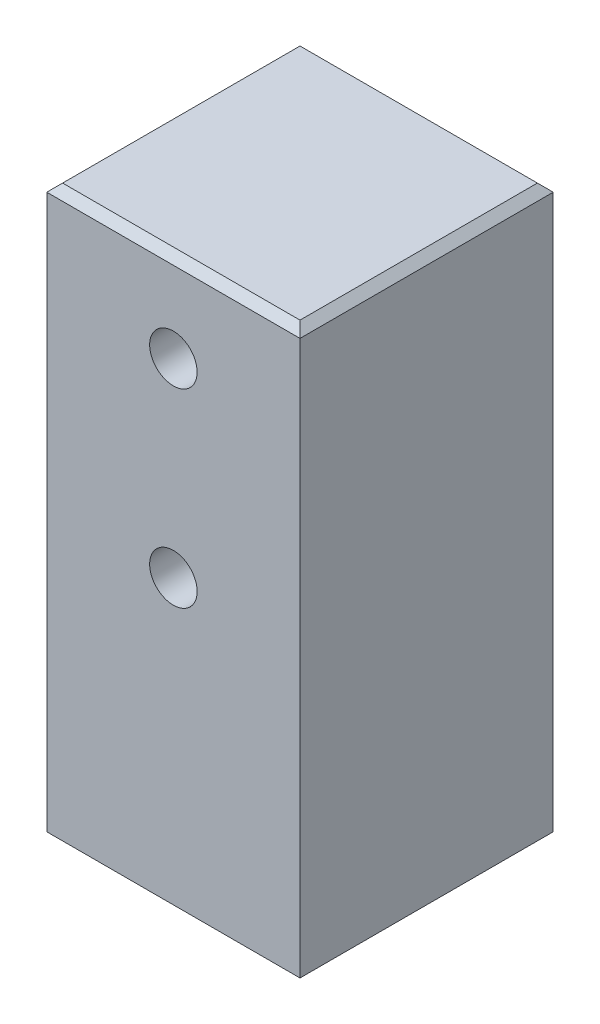
ISO-10303-21;
HEADER;
FILE_DESCRIPTION(('STEP AP214'),'2;1');
FILE_NAME('part.step','',(''),(''),'','','');
FILE_SCHEMA(('AUTOMOTIVE_DESIGN { 1 0 10303 214 1 1 1 1 }'));
ENDSEC;
DATA;
#1=APPLICATION_CONTEXT('core data for automotive mechanical design processes');
#2=APPLICATION_PROTOCOL_DEFINITION('international standard','automotive_design',2000,#1);
#3=PRODUCT_CONTEXT('',#1,'mechanical');
#4=PRODUCT('Part','Part','',(#3));
#5=PRODUCT_RELATED_PRODUCT_CATEGORY('part','',(#4));
#6=PRODUCT_DEFINITION_FORMATION('','',#4);
#7=PRODUCT_DEFINITION_CONTEXT('part definition',#1,'design');
#8=PRODUCT_DEFINITION('design','',#6,#7);
#9=PRODUCT_DEFINITION_SHAPE('','',#8);
#10=(LENGTH_UNIT() NAMED_UNIT(*) SI_UNIT(.MILLI.,.METRE.));
#11=(NAMED_UNIT(*) PLANE_ANGLE_UNIT() SI_UNIT($,.RADIAN.));
#12=(NAMED_UNIT(*) SI_UNIT($,.STERADIAN.) SOLID_ANGLE_UNIT());
#13=UNCERTAINTY_MEASURE_WITH_UNIT(LENGTH_MEASURE(1.E-05),#10,'distance_accuracy_value','');
#14=(GEOMETRIC_REPRESENTATION_CONTEXT(3) GLOBAL_UNCERTAINTY_ASSIGNED_CONTEXT((#13)) GLOBAL_UNIT_ASSIGNED_CONTEXT((#10,
#11,#12)) REPRESENTATION_CONTEXT('',''));
#15=CARTESIAN_POINT('',(0.,0.,0.));
#16=DIRECTION('',(0.,0.,1.));
#17=DIRECTION('',(1.,0.,0.));
#18=AXIS2_PLACEMENT_3D('',#15,#16,#17);
#19=CARTESIAN_POINT('',(12.7,28.575,-12.7));
#20=DIRECTION('',(-1.,0.,0.));
#21=DIRECTION('',(0.,0.,1.));
#22=AXIS2_PLACEMENT_3D('',#19,#20,#21);
#23=PLANE('',#22);
#24=DIRECTION('',(0.,-1.,0.));
#25=VECTOR('',#24,1.);
#26=CARTESIAN_POINT('',(12.7,28.575,-12.7));
#27=LINE('',#26,#25);
#28=CARTESIAN_POINT('',(12.7,27.78125,-12.7));
#29=VERTEX_POINT('',#28);
#30=CARTESIAN_POINT('',(12.7,-27.78125,-12.7));
#31=VERTEX_POINT('',#30);
#32=EDGE_CURVE('E118',#29,#31,#27,.T.);
#33=ORIENTED_EDGE('',*,*,#32,.F.);
#34=DIRECTION('',(0.,0.,1.));
#35=VECTOR('',#34,1.);
#36=CARTESIAN_POINT('',(12.7,27.78125,12.7));
#37=LINE('',#36,#35);
#38=CARTESIAN_POINT('',(12.7,27.78125,12.7));
#39=VERTEX_POINT('',#38);
#40=EDGE_CURVE('E142',#29,#39,#37,.T.);
#41=ORIENTED_EDGE('',*,*,#40,.T.);
#42=DIRECTION('',(0.,-1.,0.));
#43=VECTOR('',#42,1.);
#44=CARTESIAN_POINT('',(12.7,28.575,12.7));
#45=LINE('',#44,#43);
#46=CARTESIAN_POINT('',(12.7,-27.78125,12.7));
#47=VERTEX_POINT('',#46);
#48=EDGE_CURVE('E190',#39,#47,#45,.T.);
#49=ORIENTED_EDGE('',*,*,#48,.T.);
#50=DIRECTION('',(0.,0.,-1.));
#51=VECTOR('',#50,1.);
#52=CARTESIAN_POINT('',(12.7,-27.78125,-12.7));
#53=LINE('',#52,#51);
#54=EDGE_CURVE('E140',#47,#31,#53,.T.);
#55=ORIENTED_EDGE('',*,*,#54,.T.);
#56=EDGE_LOOP('',(#33,#41,#49,#55));
#57=FACE_BOUND('',#56,.T.);
#58=ADVANCED_FACE('F33',(#57),#23,.F.);
#59=CARTESIAN_POINT('',(-12.7,28.575,-12.7));
#60=DIRECTION('',(0.,0.,1.));
#61=DIRECTION('',(1.,0.,0.));
#62=AXIS2_PLACEMENT_3D('',#59,#60,#61);
#63=PLANE('',#62);
#64=CARTESIAN_POINT('',(0.,19.685,-12.7));
#65=DIRECTION('',(0.,0.,1.));
#66=DIRECTION('',(1.,0.,0.));
#67=AXIS2_PLACEMENT_3D('',#64,#65,#66);
#68=CIRCLE('',#67,2.38125);
#69=CARTESIAN_POINT('',(2.38125,19.685,-12.7));
#70=VERTEX_POINT('',#69);
#71=EDGE_CURVE('E479',#70,#70,#68,.T.);
#72=ORIENTED_EDGE('',*,*,#71,.T.);
#73=EDGE_LOOP('',(#72));
#74=FACE_BOUND('',#73,.T.);
#75=CARTESIAN_POINT('',(0.,0.635,-12.7));
#76=DIRECTION('',(0.,0.,1.));
#77=DIRECTION('',(1.,0.,0.));
#78=AXIS2_PLACEMENT_3D('',#75,#76,#77);
#79=CIRCLE('',#78,2.38125);
#80=CARTESIAN_POINT('',(2.38125,0.635,-12.7));
#81=VERTEX_POINT('',#80);
#82=EDGE_CURVE('E187',#81,#81,#79,.T.);
#83=ORIENTED_EDGE('',*,*,#82,.T.);
#84=EDGE_LOOP('',(#83));
#85=FACE_BOUND('',#84,.T.);
#86=DIRECTION('',(0.,-1.,0.));
#87=VECTOR('',#86,1.);
#88=CARTESIAN_POINT('',(-12.7,28.575,-12.7));
#89=LINE('',#88,#87);
#90=CARTESIAN_POINT('',(-12.7,27.78125,-12.7));
#91=VERTEX_POINT('',#90);
#92=CARTESIAN_POINT('',(-12.7,-27.78125,-12.7));
#93=VERTEX_POINT('',#92);
#94=EDGE_CURVE('E201',#91,#93,#89,.T.);
#95=ORIENTED_EDGE('',*,*,#94,.F.);
#96=DIRECTION('',(1.,0.,0.));
#97=VECTOR('',#96,1.);
#98=CARTESIAN_POINT('',(12.7,27.78125,-12.7));
#99=LINE('',#98,#97);
#100=EDGE_CURVE('E138',#91,#29,#99,.T.);
#101=ORIENTED_EDGE('',*,*,#100,.T.);
#102=ORIENTED_EDGE('',*,*,#32,.T.);
#103=DIRECTION('',(-1.,0.,0.));
#104=VECTOR('',#103,1.);
#105=CARTESIAN_POINT('',(-12.7,-27.78125,-12.7));
#106=LINE('',#105,#104);
#107=EDGE_CURVE('E135',#31,#93,#106,.T.);
#108=ORIENTED_EDGE('',*,*,#107,.T.);
#109=EDGE_LOOP('',(#95,#101,#102,#108));
#110=FACE_BOUND('',#109,.T.);
#111=ADVANCED_FACE('F220',(#74,#85,#110),#63,.F.);
#112=CARTESIAN_POINT('',(-12.7,28.575,-12.7));
#113=DIRECTION('',(1.,0.,0.));
#114=DIRECTION('',(0.,0.,-1.));
#115=AXIS2_PLACEMENT_3D('',#112,#113,#114);
#116=PLANE('',#115);
#117=DIRECTION('',(0.,-1.,0.));
#118=VECTOR('',#117,1.);
#119=CARTESIAN_POINT('',(-12.7,28.575,12.7));
#120=LINE('',#119,#118);
#121=CARTESIAN_POINT('',(-12.7,27.78125,12.7));
#122=VERTEX_POINT('',#121);
#123=CARTESIAN_POINT('',(-12.7,-27.78125,12.7));
#124=VERTEX_POINT('',#123);
#125=EDGE_CURVE('E198',#122,#124,#120,.T.);
#126=ORIENTED_EDGE('',*,*,#125,.F.);
#127=DIRECTION('',(0.,0.,-1.));
#128=VECTOR('',#127,1.);
#129=CARTESIAN_POINT('',(-12.7,27.78125,-12.7));
#130=LINE('',#129,#128);
#131=EDGE_CURVE('E133',#122,#91,#130,.T.);
#132=ORIENTED_EDGE('',*,*,#131,.T.);
#133=ORIENTED_EDGE('',*,*,#94,.T.);
#134=DIRECTION('',(0.,0.,1.));
#135=VECTOR('',#134,1.);
#136=CARTESIAN_POINT('',(-12.7,-27.78125,-12.7));
#137=LINE('',#136,#135);
#138=EDGE_CURVE('E131',#93,#124,#137,.T.);
#139=ORIENTED_EDGE('',*,*,#138,.T.);
#140=EDGE_LOOP('',(#126,#132,#133,#139));
#141=FACE_BOUND('',#140,.T.);
#142=ADVANCED_FACE('F218',(#141),#116,.F.);
#143=CARTESIAN_POINT('',(-12.7,28.575,12.7));
#144=DIRECTION('',(0.,0.,-1.));
#145=DIRECTION('',(-1.,0.,0.));
#146=AXIS2_PLACEMENT_3D('',#143,#144,#145);
#147=PLANE('',#146);
#148=CARTESIAN_POINT('',(0.,19.685,12.7));
#149=DIRECTION('',(0.,0.,1.));
#150=DIRECTION('',(1.,0.,0.));
#151=AXIS2_PLACEMENT_3D('',#148,#149,#150);
#152=CIRCLE('',#151,2.38125);
#153=CARTESIAN_POINT('',(2.38125,19.685,12.7));
#154=VERTEX_POINT('',#153);
#155=EDGE_CURVE('E153',#154,#154,#152,.T.);
#156=ORIENTED_EDGE('',*,*,#155,.F.);
#157=EDGE_LOOP('',(#156));
#158=FACE_BOUND('',#157,.T.);
#159=CARTESIAN_POINT('',(0.,0.635,12.7));
#160=DIRECTION('',(0.,0.,1.));
#161=DIRECTION('',(1.,0.,0.));
#162=AXIS2_PLACEMENT_3D('',#159,#160,#161);
#163=CIRCLE('',#162,2.38125);
#164=CARTESIAN_POINT('',(2.38125,0.635,12.7));
#165=VERTEX_POINT('',#164);
#166=EDGE_CURVE('E193',#165,#165,#163,.T.);
#167=ORIENTED_EDGE('',*,*,#166,.F.);
#168=EDGE_LOOP('',(#167));
#169=FACE_BOUND('',#168,.T.);
#170=ORIENTED_EDGE('',*,*,#48,.F.);
#171=DIRECTION('',(-1.,0.,0.));
#172=VECTOR('',#171,1.);
#173=CARTESIAN_POINT('',(-12.7,27.78125,12.7));
#174=LINE('',#173,#172);
#175=EDGE_CURVE('E105',#39,#122,#174,.T.);
#176=ORIENTED_EDGE('',*,*,#175,.T.);
#177=ORIENTED_EDGE('',*,*,#125,.T.);
#178=DIRECTION('',(1.,0.,0.));
#179=VECTOR('',#178,1.);
#180=CARTESIAN_POINT('',(-12.7,-27.78125,12.7));
#181=LINE('',#180,#179);
#182=EDGE_CURVE('E124',#124,#47,#181,.T.);
#183=ORIENTED_EDGE('',*,*,#182,.T.);
#184=EDGE_LOOP('',(#170,#176,#177,#183));
#185=FACE_BOUND('',#184,.T.);
#186=ADVANCED_FACE('F217',(#158,#169,#185),#147,.F.);
#187=CARTESIAN_POINT('',(0.,28.575,0.));
#188=DIRECTION('',(0.,1.,0.));
#189=DIRECTION('',(0.,0.,1.));
#190=AXIS2_PLACEMENT_3D('',#187,#188,#189);
#191=PLANE('',#190);
#192=DIRECTION('',(0.,0.,1.));
#193=VECTOR('',#192,1.);
#194=CARTESIAN_POINT('',(-11.90625,28.575,12.7));
#195=LINE('',#194,#193);
#196=CARTESIAN_POINT('',(-11.90625,28.575,-11.90625));
#197=VERTEX_POINT('',#196);
#198=CARTESIAN_POINT('',(-11.90625,28.575,11.90625));
#199=VERTEX_POINT('',#198);
#200=EDGE_CURVE('E122',#197,#199,#195,.T.);
#201=ORIENTED_EDGE('',*,*,#200,.T.);
#202=DIRECTION('',(1.,0.,0.));
#203=VECTOR('',#202,1.);
#204=CARTESIAN_POINT('',(12.7,28.575,11.90625));
#205=LINE('',#204,#203);
#206=CARTESIAN_POINT('',(11.90625,28.575,11.90625));
#207=VERTEX_POINT('',#206);
#208=EDGE_CURVE('E103',#199,#207,#205,.T.);
#209=ORIENTED_EDGE('',*,*,#208,.T.);
#210=DIRECTION('',(0.,0.,-1.));
#211=VECTOR('',#210,1.);
#212=CARTESIAN_POINT('',(11.90625,28.575,-12.7));
#213=LINE('',#212,#211);
#214=CARTESIAN_POINT('',(11.90625,28.575,-11.90625));
#215=VERTEX_POINT('',#214);
#216=EDGE_CURVE('E111',#207,#215,#213,.T.);
#217=ORIENTED_EDGE('',*,*,#216,.T.);
#218=DIRECTION('',(-1.,0.,0.));
#219=VECTOR('',#218,1.);
#220=CARTESIAN_POINT('',(-12.7,28.575,-11.90625));
#221=LINE('',#220,#219);
#222=EDGE_CURVE('E117',#215,#197,#221,.T.);
#223=ORIENTED_EDGE('',*,*,#222,.T.);
#224=EDGE_LOOP('',(#201,#209,#217,#223));
#225=FACE_BOUND('',#224,.T.);
#226=ADVANCED_FACE('F120',(#225),#191,.T.);
#227=CARTESIAN_POINT('',(0.,-28.575,0.));
#228=DIRECTION('',(0.,1.,0.));
#229=DIRECTION('',(0.,0.,1.));
#230=AXIS2_PLACEMENT_3D('',#227,#228,#229);
#231=PLANE('',#230);
#232=CARTESIAN_POINT('',(-5.65685424949239,-28.575,5.65685424949236));
#233=DIRECTION('',(0.,-1.,0.));
#234=DIRECTION('',(0.,0.,-1.));
#235=AXIS2_PLACEMENT_3D('',#232,#233,#234);
#236=CIRCLE('',#235,1.35254999999999);
#237=CARTESIAN_POINT('',(-5.65685424949239,-28.575,4.30430424949238));
#238=VERTEX_POINT('',#237);
#239=EDGE_CURVE('E455',#238,#238,#236,.T.);
#240=ORIENTED_EDGE('',*,*,#239,.F.);
#241=EDGE_LOOP('',(#240));
#242=FACE_BOUND('',#241,.T.);
#243=CARTESIAN_POINT('',(5.65685424949237,-28.575,5.65685424949238));
#244=DIRECTION('',(0.,-1.,0.));
#245=DIRECTION('',(0.,0.,-1.));
#246=AXIS2_PLACEMENT_3D('',#243,#244,#245);
#247=CIRCLE('',#246,1.35254999999999);
#248=CARTESIAN_POINT('',(5.65685424949237,-28.575,4.3043042494924));
#249=VERTEX_POINT('',#248);
#250=EDGE_CURVE('E456',#249,#249,#247,.T.);
#251=ORIENTED_EDGE('',*,*,#250,.F.);
#252=EDGE_LOOP('',(#251));
#253=FACE_BOUND('',#252,.T.);
#254=CARTESIAN_POINT('',(5.65685424949239,-28.575,-5.65685424949238));
#255=DIRECTION('',(0.,-1.,0.));
#256=DIRECTION('',(0.,0.,-1.));
#257=AXIS2_PLACEMENT_3D('',#254,#255,#256);
#258=CIRCLE('',#257,1.35254999999999);
#259=CARTESIAN_POINT('',(5.65685424949239,-28.575,-7.00940424949236));
#260=VERTEX_POINT('',#259);
#261=EDGE_CURVE('E467',#260,#260,#258,.T.);
#262=ORIENTED_EDGE('',*,*,#261,.F.);
#263=EDGE_LOOP('',(#262));
#264=FACE_BOUND('',#263,.T.);
#265=CARTESIAN_POINT('',(-5.65685424949237,-28.575,-5.6568542494924));
#266=DIRECTION('',(0.,-1.,0.));
#267=DIRECTION('',(0.,0.,-1.));
#268=AXIS2_PLACEMENT_3D('',#265,#266,#267);
#269=CIRCLE('',#268,1.35254999999999);
#270=CARTESIAN_POINT('',(-5.65685424949237,-28.575,-7.00940424949238));
#271=VERTEX_POINT('',#270);
#272=EDGE_CURVE('E459',#271,#271,#269,.T.);
#273=ORIENTED_EDGE('',*,*,#272,.F.);
#274=EDGE_LOOP('',(#273));
#275=FACE_BOUND('',#274,.T.);
#276=DIRECTION('',(0.,0.,-1.));
#277=VECTOR('',#276,1.);
#278=CARTESIAN_POINT('',(-11.90625,-28.575,0.));
#279=LINE('',#278,#277);
#280=CARTESIAN_POINT('',(-11.90625,-28.575,11.90625));
#281=VERTEX_POINT('',#280);
#282=CARTESIAN_POINT('',(-11.90625,-28.575,-11.90625));
#283=VERTEX_POINT('',#282);
#284=EDGE_CURVE('E42',#281,#283,#279,.T.);
#285=ORIENTED_EDGE('',*,*,#284,.T.);
#286=DIRECTION('',(1.,0.,0.));
#287=VECTOR('',#286,1.);
#288=CARTESIAN_POINT('',(0.,-28.575,-11.90625));
#289=LINE('',#288,#287);
#290=CARTESIAN_POINT('',(11.90625,-28.575,-11.90625));
#291=VERTEX_POINT('',#290);
#292=EDGE_CURVE('E11',#283,#291,#289,.T.);
#293=ORIENTED_EDGE('',*,*,#292,.T.);
#294=DIRECTION('',(0.,0.,1.));
#295=VECTOR('',#294,1.);
#296=CARTESIAN_POINT('',(11.90625,-28.575,0.));
#297=LINE('',#296,#295);
#298=CARTESIAN_POINT('',(11.90625,-28.575,11.90625));
#299=VERTEX_POINT('',#298);
#300=EDGE_CURVE('E144',#291,#299,#297,.T.);
#301=ORIENTED_EDGE('',*,*,#300,.T.);
#302=DIRECTION('',(-1.,0.,0.));
#303=VECTOR('',#302,1.);
#304=CARTESIAN_POINT('',(0.,-28.575,11.90625));
#305=LINE('',#304,#303);
#306=EDGE_CURVE('E53',#299,#281,#305,.T.);
#307=ORIENTED_EDGE('',*,*,#306,.T.);
#308=EDGE_LOOP('',(#285,#293,#301,#307));
#309=FACE_BOUND('',#308,.T.);
#310=CARTESIAN_POINT('',(0.,-28.575,0.));
#311=DIRECTION('',(0.,-1.,0.));
#312=DIRECTION('',(0.,0.,-1.));
#313=AXIS2_PLACEMENT_3D('',#310,#311,#312);
#314=CIRCLE('',#313,3.175);
#315=CARTESIAN_POINT('',(0.,-28.575,-3.175));
#316=VERTEX_POINT('',#315);
#317=EDGE_CURVE('E184',#316,#316,#314,.T.);
#318=ORIENTED_EDGE('',*,*,#317,.F.);
#319=EDGE_LOOP('',(#318));
#320=FACE_BOUND('',#319,.T.);
#321=ADVANCED_FACE('F176',(#242,#253,#264,#275,#309,#320),#231,.F.);
#322=CARTESIAN_POINT('',(0.,-12.065,0.));
#323=DIRECTION('',(0.,-1.,0.));
#324=DIRECTION('',(0.,0.,-1.));
#325=AXIS2_PLACEMENT_3D('',#322,#323,#324);
#326=CYLINDRICAL_SURFACE('',#325,3.175);
#327=CARTESIAN_POINT('',(0.,-12.065,0.));
#328=DIRECTION('',(0.,-1.,0.));
#329=DIRECTION('',(0.,0.,-1.));
#330=AXIS2_PLACEMENT_3D('',#327,#328,#329);
#331=CIRCLE('',#330,3.175);
#332=CARTESIAN_POINT('',(0.,-12.065,-3.175));
#333=VERTEX_POINT('',#332);
#334=EDGE_CURVE('E186',#333,#333,#331,.T.);
#335=ORIENTED_EDGE('',*,*,#334,.F.);
#336=EDGE_LOOP('',(#335));
#337=FACE_BOUND('',#336,.T.);
#338=ORIENTED_EDGE('',*,*,#317,.T.);
#339=EDGE_LOOP('',(#338));
#340=FACE_BOUND('',#339,.T.);
#341=ADVANCED_FACE('F179',(#337,#340),#326,.F.);
#342=CARTESIAN_POINT('',(0.,-12.065,0.));
#343=DIRECTION('',(0.,-1.,0.));
#344=DIRECTION('',(0.,0.,-1.));
#345=AXIS2_PLACEMENT_3D('',#342,#343,#344);
#346=PLANE('',#345);
#347=ORIENTED_EDGE('',*,*,#334,.T.);
#348=EDGE_LOOP('',(#347));
#349=FACE_BOUND('',#348,.T.);
#350=ADVANCED_FACE('F282',(#349),#346,.T.);
#351=CARTESIAN_POINT('',(0.,0.635,-12.7));
#352=DIRECTION('',(0.,0.,1.));
#353=DIRECTION('',(1.,0.,0.));
#354=AXIS2_PLACEMENT_3D('',#351,#352,#353);
#355=CYLINDRICAL_SURFACE('',#354,2.38125);
#356=ORIENTED_EDGE('',*,*,#82,.F.);
#357=EDGE_LOOP('',(#356));
#358=FACE_BOUND('',#357,.T.);
#359=ORIENTED_EDGE('',*,*,#166,.T.);
#360=EDGE_LOOP('',(#359));
#361=FACE_BOUND('',#360,.T.);
#362=ADVANCED_FACE('F274',(#358,#361),#355,.F.);
#363=CARTESIAN_POINT('',(0.,19.685,-12.7));
#364=DIRECTION('',(0.,0.,1.));
#365=DIRECTION('',(1.,0.,0.));
#366=AXIS2_PLACEMENT_3D('',#363,#364,#365);
#367=CYLINDRICAL_SURFACE('',#366,2.38125);
#368=ORIENTED_EDGE('',*,*,#71,.F.);
#369=EDGE_LOOP('',(#368));
#370=FACE_BOUND('',#369,.T.);
#371=ORIENTED_EDGE('',*,*,#155,.T.);
#372=EDGE_LOOP('',(#371));
#373=FACE_BOUND('',#372,.T.);
#374=ADVANCED_FACE('F240',(#370,#373),#367,.F.);
#375=CARTESIAN_POINT('',(0.,28.575,-11.90625));
#376=DIRECTION('',(0.,0.707106781186548,-0.707106781186548));
#377=DIRECTION('',(1.,0.,0.));
#378=AXIS2_PLACEMENT_3D('',#375,#376,#377);
#379=PLANE('',#378);
#380=DIRECTION('',(-0.577350269189626,0.577350269189626,0.577350269189626));
#381=VECTOR('',#380,1.);
#382=CARTESIAN_POINT('',(7.93749999999999,32.54375,-7.93749999999999));
#383=LINE('',#382,#381);
#384=EDGE_CURVE('E114',#29,#215,#383,.T.);
#385=ORIENTED_EDGE('',*,*,#384,.F.);
#386=ORIENTED_EDGE('',*,*,#100,.F.);
#387=DIRECTION('',(0.577350269189626,0.577350269189626,0.577350269189626));
#388=VECTOR('',#387,1.);
#389=CARTESIAN_POINT('',(-7.93749999999999,32.54375,-7.93749999999999));
#390=LINE('',#389,#388);
#391=EDGE_CURVE('E150',#197,#91,#390,.F.);
#392=ORIENTED_EDGE('',*,*,#391,.F.);
#393=ORIENTED_EDGE('',*,*,#222,.F.);
#394=EDGE_LOOP('',(#385,#386,#392,#393));
#395=FACE_BOUND('',#394,.T.);
#396=ADVANCED_FACE('F208',(#395),#379,.T.);
#397=CARTESIAN_POINT('',(-11.90625,28.575,0.));
#398=DIRECTION('',(-0.707106781186548,0.707106781186548,0.));
#399=DIRECTION('',(0.,0.,-1.));
#400=AXIS2_PLACEMENT_3D('',#397,#398,#399);
#401=PLANE('',#400);
#402=ORIENTED_EDGE('',*,*,#391,.T.);
#403=ORIENTED_EDGE('',*,*,#131,.F.);
#404=DIRECTION('',(0.577350269189626,0.577350269189626,-0.577350269189626));
#405=VECTOR('',#404,1.);
#406=CARTESIAN_POINT('',(-7.93749999999999,32.54375,7.93749999999999));
#407=LINE('',#406,#405);
#408=EDGE_CURVE('E108',#199,#122,#407,.F.);
#409=ORIENTED_EDGE('',*,*,#408,.F.);
#410=ORIENTED_EDGE('',*,*,#200,.F.);
#411=EDGE_LOOP('',(#402,#403,#409,#410));
#412=FACE_BOUND('',#411,.T.);
#413=ADVANCED_FACE('F211',(#412),#401,.T.);
#414=CARTESIAN_POINT('',(11.90625,28.575,0.));
#415=DIRECTION('',(0.707106781186548,0.707106781186548,0.));
#416=DIRECTION('',(0.,0.,1.));
#417=AXIS2_PLACEMENT_3D('',#414,#415,#416);
#418=PLANE('',#417);
#419=ORIENTED_EDGE('',*,*,#384,.T.);
#420=ORIENTED_EDGE('',*,*,#216,.F.);
#421=DIRECTION('',(0.577350269189626,-0.577350269189626,0.577350269189626));
#422=VECTOR('',#421,1.);
#423=CARTESIAN_POINT('',(7.9375,32.54375,7.93749999999999));
#424=LINE('',#423,#422);
#425=EDGE_CURVE('E99',#39,#207,#424,.F.);
#426=ORIENTED_EDGE('',*,*,#425,.F.);
#427=ORIENTED_EDGE('',*,*,#40,.F.);
#428=EDGE_LOOP('',(#419,#420,#426,#427));
#429=FACE_BOUND('',#428,.T.);
#430=ADVANCED_FACE('F112',(#429),#418,.T.);
#431=CARTESIAN_POINT('',(0.,28.575,11.90625));
#432=DIRECTION('',(0.,0.707106781186548,0.707106781186548));
#433=DIRECTION('',(-1.,0.,0.));
#434=AXIS2_PLACEMENT_3D('',#431,#432,#433);
#435=PLANE('',#434);
#436=ORIENTED_EDGE('',*,*,#408,.T.);
#437=ORIENTED_EDGE('',*,*,#175,.F.);
#438=ORIENTED_EDGE('',*,*,#425,.T.);
#439=ORIENTED_EDGE('',*,*,#208,.F.);
#440=EDGE_LOOP('',(#436,#437,#438,#439));
#441=FACE_BOUND('',#440,.T.);
#442=ADVANCED_FACE('F101',(#441),#435,.T.);
#443=CARTESIAN_POINT('',(-12.7,-27.78125,12.7));
#444=DIRECTION('',(0.,0.707106781186548,-0.707106781186548));
#445=DIRECTION('',(1.,0.,0.));
#446=AXIS2_PLACEMENT_3D('',#443,#444,#445);
#447=PLANE('',#446);
#448=DIRECTION('',(0.577350269189626,-0.577350269189626,-0.577350269189626));
#449=VECTOR('',#448,1.);
#450=CARTESIAN_POINT('',(-12.7,-27.78125,12.7));
#451=LINE('',#450,#449);
#452=EDGE_CURVE('E158',#281,#124,#451,.F.);
#453=ORIENTED_EDGE('',*,*,#452,.F.);
#454=ORIENTED_EDGE('',*,*,#306,.F.);
#455=DIRECTION('',(-0.577350269189626,-0.577350269189626,-0.577350269189626));
#456=VECTOR('',#455,1.);
#457=CARTESIAN_POINT('',(4.23333333333334,-36.2479166666667,4.23333333333333));
#458=LINE('',#457,#456);
#459=EDGE_CURVE('E37',#47,#299,#458,.T.);
#460=ORIENTED_EDGE('',*,*,#459,.F.);
#461=ORIENTED_EDGE('',*,*,#182,.F.);
#462=EDGE_LOOP('',(#453,#454,#460,#461));
#463=FACE_BOUND('',#462,.T.);
#464=ADVANCED_FACE('F35',(#463),#447,.F.);
#465=CARTESIAN_POINT('',(12.7,-27.78125,-12.7));
#466=DIRECTION('',(-0.707106781186548,0.707106781186548,0.));
#467=DIRECTION('',(0.,0.,-1.));
#468=AXIS2_PLACEMENT_3D('',#465,#466,#467);
#469=PLANE('',#468);
#470=ORIENTED_EDGE('',*,*,#459,.T.);
#471=ORIENTED_EDGE('',*,*,#300,.F.);
#472=DIRECTION('',(0.577350269189626,0.577350269189626,-0.577350269189626));
#473=VECTOR('',#472,1.);
#474=CARTESIAN_POINT('',(12.7,-27.78125,-12.7));
#475=LINE('',#474,#473);
#476=EDGE_CURVE('E156',#31,#291,#475,.F.);
#477=ORIENTED_EDGE('',*,*,#476,.F.);
#478=ORIENTED_EDGE('',*,*,#54,.F.);
#479=EDGE_LOOP('',(#470,#471,#477,#478));
#480=FACE_BOUND('',#479,.T.);
#481=ADVANCED_FACE('F167',(#480),#469,.F.);
#482=CARTESIAN_POINT('',(-12.7,-27.78125,-12.7));
#483=DIRECTION('',(0.707106781186548,0.707106781186548,0.));
#484=DIRECTION('',(0.,0.,1.));
#485=AXIS2_PLACEMENT_3D('',#482,#483,#484);
#486=PLANE('',#485);
#487=ORIENTED_EDGE('',*,*,#452,.T.);
#488=ORIENTED_EDGE('',*,*,#138,.F.);
#489=DIRECTION('',(0.577350269189626,-0.577350269189626,0.577350269189626));
#490=VECTOR('',#489,1.);
#491=CARTESIAN_POINT('',(-12.7,-27.78125,-12.7));
#492=LINE('',#491,#490);
#493=EDGE_CURVE('E154',#283,#93,#492,.F.);
#494=ORIENTED_EDGE('',*,*,#493,.F.);
#495=ORIENTED_EDGE('',*,*,#284,.F.);
#496=EDGE_LOOP('',(#487,#488,#494,#495));
#497=FACE_BOUND('',#496,.T.);
#498=ADVANCED_FACE('F172',(#497),#486,.F.);
#499=CARTESIAN_POINT('',(-12.7,-27.78125,-12.7));
#500=DIRECTION('',(0.,0.707106781186548,0.707106781186548));
#501=DIRECTION('',(-1.,0.,0.));
#502=AXIS2_PLACEMENT_3D('',#499,#500,#501);
#503=PLANE('',#502);
#504=ORIENTED_EDGE('',*,*,#476,.T.);
#505=ORIENTED_EDGE('',*,*,#292,.F.);
#506=ORIENTED_EDGE('',*,*,#493,.T.);
#507=ORIENTED_EDGE('',*,*,#107,.F.);
#508=EDGE_LOOP('',(#504,#505,#506,#507));
#509=FACE_BOUND('',#508,.T.);
#510=ADVANCED_FACE('F175',(#509),#503,.F.);
#511=CARTESIAN_POINT('',(-5.65685424949237,-22.225,-5.6568542494924));
#512=DIRECTION('',(0.,-1.,0.));
#513=DIRECTION('',(0.,0.,-1.));
#514=AXIS2_PLACEMENT_3D('',#511,#512,#513);
#515=CYLINDRICAL_SURFACE('',#514,1.35254999999999);
#516=CARTESIAN_POINT('',(-5.65685424949237,-22.225,-5.6568542494924));
#517=DIRECTION('',(0.,-1.,0.));
#518=DIRECTION('',(0.,0.,-1.));
#519=AXIS2_PLACEMENT_3D('',#516,#517,#518);
#520=CIRCLE('',#519,1.35254999999999);
#521=CARTESIAN_POINT('',(-5.65685424949237,-22.225,-7.00940424949238));
#522=VERTEX_POINT('',#521);
#523=EDGE_CURVE('E157',#522,#522,#520,.T.);
#524=ORIENTED_EDGE('',*,*,#523,.F.);
#525=EDGE_LOOP('',(#524));
#526=FACE_BOUND('',#525,.T.);
#527=ORIENTED_EDGE('',*,*,#272,.T.);
#528=EDGE_LOOP('',(#527));
#529=FACE_BOUND('',#528,.T.);
#530=ADVANCED_FACE('F243',(#526,#529),#515,.F.);
#531=CARTESIAN_POINT('',(-5.65685424949237,-22.225,-5.6568542494924));
#532=DIRECTION('',(0.,-1.,0.));
#533=DIRECTION('',(0.,0.,-1.));
#534=AXIS2_PLACEMENT_3D('',#531,#532,#533);
#535=PLANE('',#534);
#536=ORIENTED_EDGE('',*,*,#523,.T.);
#537=EDGE_LOOP('',(#536));
#538=FACE_BOUND('',#537,.T.);
#539=ADVANCED_FACE('F377',(#538),#535,.T.);
#540=CARTESIAN_POINT('',(5.65685424949239,-22.225,-5.65685424949238));
#541=DIRECTION('',(0.,-1.,0.));
#542=DIRECTION('',(0.,0.,-1.));
#543=AXIS2_PLACEMENT_3D('',#540,#541,#542);
#544=CYLINDRICAL_SURFACE('',#543,1.35254999999999);
#545=CARTESIAN_POINT('',(5.65685424949239,-22.225,-5.65685424949238));
#546=DIRECTION('',(0.,-1.,0.));
#547=DIRECTION('',(0.,0.,-1.));
#548=AXIS2_PLACEMENT_3D('',#545,#546,#547);
#549=CIRCLE('',#548,1.35254999999999);
#550=CARTESIAN_POINT('',(5.65685424949239,-22.225,-7.00940424949236));
#551=VERTEX_POINT('',#550);
#552=EDGE_CURVE('E470',#551,#551,#549,.T.);
#553=ORIENTED_EDGE('',*,*,#552,.F.);
#554=EDGE_LOOP('',(#553));
#555=FACE_BOUND('',#554,.T.);
#556=ORIENTED_EDGE('',*,*,#261,.T.);
#557=EDGE_LOOP('',(#556));
#558=FACE_BOUND('',#557,.T.);
#559=ADVANCED_FACE('F386',(#555,#558),#544,.F.);
#560=CARTESIAN_POINT('',(5.65685424949239,-22.225,-5.65685424949238));
#561=DIRECTION('',(0.,-1.,0.));
#562=DIRECTION('',(0.,0.,-1.));
#563=AXIS2_PLACEMENT_3D('',#560,#561,#562);
#564=PLANE('',#563);
#565=ORIENTED_EDGE('',*,*,#552,.T.);
#566=EDGE_LOOP('',(#565));
#567=FACE_BOUND('',#566,.T.);
#568=ADVANCED_FACE('F395',(#567),#564,.T.);
#569=CARTESIAN_POINT('',(5.65685424949237,-22.225,5.65685424949238));
#570=DIRECTION('',(0.,-1.,0.));
#571=DIRECTION('',(0.,0.,-1.));
#572=AXIS2_PLACEMENT_3D('',#569,#570,#571);
#573=CYLINDRICAL_SURFACE('',#572,1.35254999999999);
#574=CARTESIAN_POINT('',(5.65685424949237,-22.225,5.65685424949238));
#575=DIRECTION('',(0.,-1.,0.));
#576=DIRECTION('',(0.,0.,-1.));
#577=AXIS2_PLACEMENT_3D('',#574,#575,#576);
#578=CIRCLE('',#577,1.35254999999999);
#579=CARTESIAN_POINT('',(5.65685424949237,-22.225,4.3043042494924));
#580=VERTEX_POINT('',#579);
#581=EDGE_CURVE('E462',#580,#580,#578,.T.);
#582=ORIENTED_EDGE('',*,*,#581,.F.);
#583=EDGE_LOOP('',(#582));
#584=FACE_BOUND('',#583,.T.);
#585=ORIENTED_EDGE('',*,*,#250,.T.);
#586=EDGE_LOOP('',(#585));
#587=FACE_BOUND('',#586,.T.);
#588=ADVANCED_FACE('F404',(#584,#587),#573,.F.);
#589=CARTESIAN_POINT('',(5.65685424949237,-22.225,5.65685424949238));
#590=DIRECTION('',(0.,-1.,0.));
#591=DIRECTION('',(0.,0.,-1.));
#592=AXIS2_PLACEMENT_3D('',#589,#590,#591);
#593=PLANE('',#592);
#594=ORIENTED_EDGE('',*,*,#581,.T.);
#595=EDGE_LOOP('',(#594));
#596=FACE_BOUND('',#595,.T.);
#597=ADVANCED_FACE('F413',(#596),#593,.T.);
#598=CARTESIAN_POINT('',(-5.65685424949239,-22.225,5.65685424949236));
#599=DIRECTION('',(0.,-1.,0.));
#600=DIRECTION('',(0.,0.,-1.));
#601=AXIS2_PLACEMENT_3D('',#598,#599,#600);
#602=CYLINDRICAL_SURFACE('',#601,1.35254999999999);
#603=CARTESIAN_POINT('',(-5.65685424949239,-22.225,5.65685424949236));
#604=DIRECTION('',(0.,-1.,0.));
#605=DIRECTION('',(0.,0.,-1.));
#606=AXIS2_PLACEMENT_3D('',#603,#604,#605);
#607=CIRCLE('',#606,1.35254999999999);
#608=CARTESIAN_POINT('',(-5.65685424949239,-22.225,4.30430424949238));
#609=VERTEX_POINT('',#608);
#610=EDGE_CURVE('E454',#609,#609,#607,.T.);
#611=ORIENTED_EDGE('',*,*,#610,.F.);
#612=EDGE_LOOP('',(#611));
#613=FACE_BOUND('',#612,.T.);
#614=ORIENTED_EDGE('',*,*,#239,.T.);
#615=EDGE_LOOP('',(#614));
#616=FACE_BOUND('',#615,.T.);
#617=ADVANCED_FACE('F422',(#613,#616),#602,.F.);
#618=CARTESIAN_POINT('',(-5.65685424949239,-22.225,5.65685424949236));
#619=DIRECTION('',(0.,-1.,0.));
#620=DIRECTION('',(0.,0.,-1.));
#621=AXIS2_PLACEMENT_3D('',#618,#619,#620);
#622=PLANE('',#621);
#623=ORIENTED_EDGE('',*,*,#610,.T.);
#624=EDGE_LOOP('',(#623));
#625=FACE_BOUND('',#624,.T.);
#626=ADVANCED_FACE('F431',(#625),#622,.T.);
#627=CLOSED_SHELL('',(#58,#111,#142,#186,#226,#321,#341,#350,#362,#374,#396,#413,#430,#442,#464,
#481,#498,#510,#530,#539,#559,#568,#588,#597,#617,#626));
#628=MANIFOLD_SOLID_BREP('B2',#627);
#629=ADVANCED_BREP_SHAPE_REPRESENTATION('',(#18,#628),#14);
#630=SHAPE_DEFINITION_REPRESENTATION(#9,#629);
ENDSEC;
END-ISO-10303-21;
